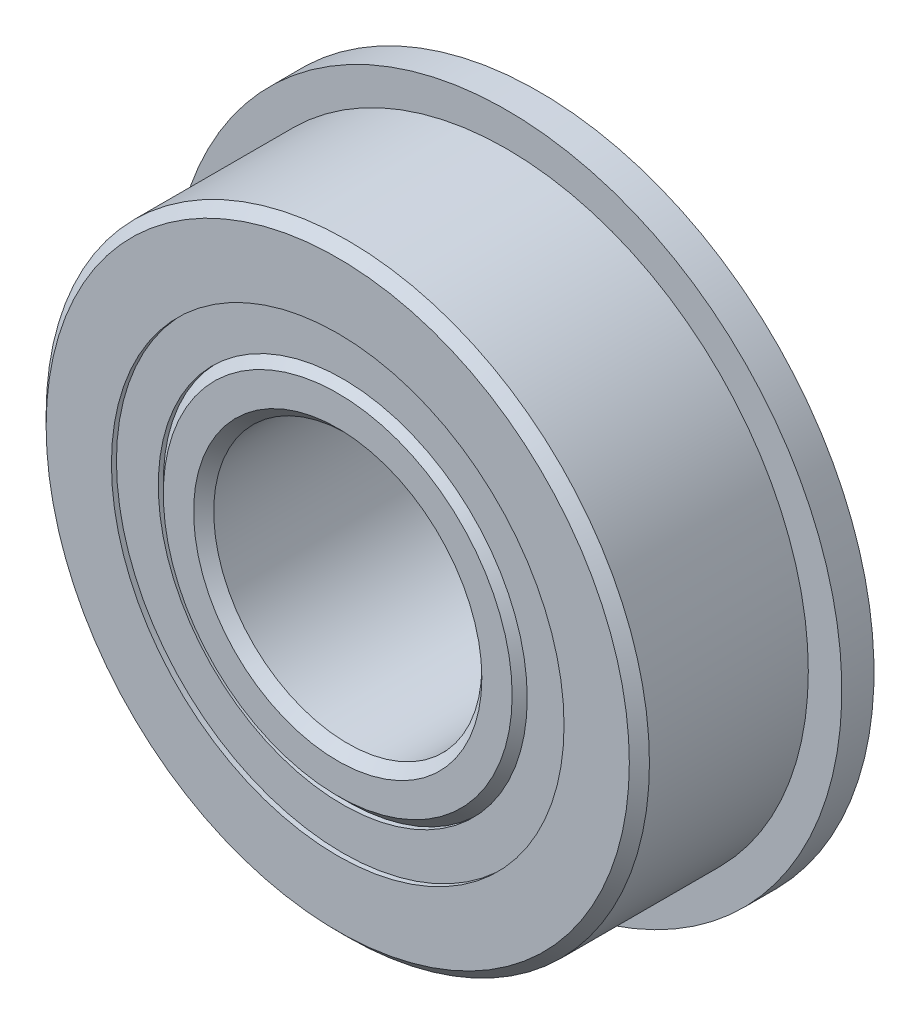
ISO-10303-21;
HEADER;
FILE_DESCRIPTION(('STEP AP214'),'2;1');
FILE_NAME('part.step','',(''),(''),'','','');
FILE_SCHEMA(('AUTOMOTIVE_DESIGN { 1 0 10303 214 1 1 1 1 }'));
ENDSEC;
DATA;
#1=APPLICATION_CONTEXT('core data for automotive mechanical design processes');
#2=APPLICATION_PROTOCOL_DEFINITION('international standard','automotive_design',2000,#1);
#3=PRODUCT_CONTEXT('',#1,'mechanical');
#4=PRODUCT('Part','Part','',(#3));
#5=PRODUCT_RELATED_PRODUCT_CATEGORY('part','',(#4));
#6=PRODUCT_DEFINITION_FORMATION('','',#4);
#7=PRODUCT_DEFINITION_CONTEXT('part definition',#1,'design');
#8=PRODUCT_DEFINITION('design','',#6,#7);
#9=PRODUCT_DEFINITION_SHAPE('','',#8);
#10=(LENGTH_UNIT() NAMED_UNIT(*) SI_UNIT(.MILLI.,.METRE.));
#11=(NAMED_UNIT(*) PLANE_ANGLE_UNIT() SI_UNIT($,.RADIAN.));
#12=(NAMED_UNIT(*) SI_UNIT($,.STERADIAN.) SOLID_ANGLE_UNIT());
#13=UNCERTAINTY_MEASURE_WITH_UNIT(LENGTH_MEASURE(1.E-05),#10,'distance_accuracy_value','');
#14=(GEOMETRIC_REPRESENTATION_CONTEXT(3) GLOBAL_UNCERTAINTY_ASSIGNED_CONTEXT((#13)) GLOBAL_UNIT_ASSIGNED_CONTEXT((#10,
#11,#12)) REPRESENTATION_CONTEXT('',''));
#15=CARTESIAN_POINT('',(0.,0.,0.));
#16=DIRECTION('',(0.,0.,1.));
#17=DIRECTION('',(1.,0.,0.));
#18=AXIS2_PLACEMENT_3D('',#15,#16,#17);
#19=CARTESIAN_POINT('',(0.,10.7188,-4.524375));
#20=DIRECTION('',(0.,0.,1.));
#21=DIRECTION('',(1.,0.,0.));
#22=AXIS2_PLACEMENT_3D('',#19,#20,#21);
#23=PLANE('',#22);
#24=CARTESIAN_POINT('',(0.,0.,-4.524375));
#25=DIRECTION('',(0.,0.,1.));
#26=DIRECTION('',(1.,0.,0.));
#27=AXIS2_PLACEMENT_3D('',#24,#25,#26);
#28=CIRCLE('',#27,10.7188);
#29=CARTESIAN_POINT('',(10.7188,0.,-4.524375));
#30=VERTEX_POINT('',#29);
#31=EDGE_CURVE('E59',#30,#30,#28,.T.);
#32=ORIENTED_EDGE('',*,*,#31,.F.);
#33=EDGE_LOOP('',(#32));
#34=FACE_BOUND('',#33,.T.);
#35=CARTESIAN_POINT('',(0.,0.,-4.524375));
#36=DIRECTION('',(0.,0.,1.));
#37=DIRECTION('',(1.,0.,0.));
#38=AXIS2_PLACEMENT_3D('',#35,#36,#37);
#39=CIRCLE('',#38,8.7376);
#40=CARTESIAN_POINT('',(8.7376,0.,-4.524375));
#41=VERTEX_POINT('',#40);
#42=EDGE_CURVE('E11',#41,#41,#39,.T.);
#43=ORIENTED_EDGE('',*,*,#42,.T.);
#44=EDGE_LOOP('',(#43));
#45=FACE_BOUND('',#44,.T.);
#46=ADVANCED_FACE('F45',(#34,#45),#23,.F.);
#47=CARTESIAN_POINT('',(0.,0.,4.7625));
#48=DIRECTION('',(0.,0.,1.));
#49=DIRECTION('',(1.,0.,0.));
#50=AXIS2_PLACEMENT_3D('',#47,#48,#49);
#51=CYLINDRICAL_SURFACE('',#50,8.7376);
#52=ORIENTED_EDGE('',*,*,#42,.F.);
#53=EDGE_LOOP('',(#52));
#54=FACE_BOUND('',#53,.T.);
#55=CARTESIAN_POINT('',(0.,0.,-1.78053818830151));
#56=DIRECTION('',(0.,0.,1.));
#57=DIRECTION('',(1.,0.,0.));
#58=AXIS2_PLACEMENT_3D('',#55,#56,#57);
#59=CIRCLE('',#58,8.7376);
#60=CARTESIAN_POINT('',(8.7376,0.,-1.78053818830151));
#61=VERTEX_POINT('',#60);
#62=EDGE_CURVE('E51',#61,#61,#59,.T.);
#63=ORIENTED_EDGE('',*,*,#62,.T.);
#64=EDGE_LOOP('',(#63));
#65=FACE_BOUND('',#64,.T.);
#66=ADVANCED_FACE('F68',(#54,#65),#51,.F.);
#67=CARTESIAN_POINT('',(0.,10.7188,-1.78053818830151));
#68=DIRECTION('',(0.,0.,-1.));
#69=DIRECTION('',(-1.,0.,0.));
#70=AXIS2_PLACEMENT_3D('',#67,#68,#69);
#71=PLANE('',#70);
#72=ORIENTED_EDGE('',*,*,#62,.F.);
#73=EDGE_LOOP('',(#72));
#74=FACE_BOUND('',#73,.T.);
#75=CARTESIAN_POINT('',(0.,0.,-1.78053818830151));
#76=DIRECTION('',(0.,0.,1.));
#77=DIRECTION('',(1.,0.,0.));
#78=AXIS2_PLACEMENT_3D('',#75,#76,#77);
#79=CIRCLE('',#78,10.7188);
#80=CARTESIAN_POINT('',(10.7188,0.,-1.78053818830151));
#81=VERTEX_POINT('',#80);
#82=EDGE_CURVE('E55',#81,#81,#79,.T.);
#83=ORIENTED_EDGE('',*,*,#82,.T.);
#84=EDGE_LOOP('',(#83));
#85=FACE_BOUND('',#84,.T.);
#86=ADVANCED_FACE('F72',(#74,#85),#71,.F.);
#87=CARTESIAN_POINT('',(0.,0.,4.7625));
#88=DIRECTION('',(0.,0.,1.));
#89=DIRECTION('',(1.,0.,0.));
#90=AXIS2_PLACEMENT_3D('',#87,#88,#89);
#91=CYLINDRICAL_SURFACE('',#90,10.7188);
#92=ORIENTED_EDGE('',*,*,#82,.F.);
#93=EDGE_LOOP('',(#92));
#94=FACE_BOUND('',#93,.T.);
#95=ORIENTED_EDGE('',*,*,#31,.T.);
#96=EDGE_LOOP('',(#95));
#97=FACE_BOUND('',#96,.T.);
#98=ADVANCED_FACE('F65',(#94,#97),#91,.T.);
#99=CLOSED_SHELL('',(#46,#66,#86,#98));
#100=MANIFOLD_SOLID_BREP('B2',#99);
#101=CARTESIAN_POINT('',(0.,10.7188,4.524375));
#102=DIRECTION('',(0.,0.,-1.));
#103=DIRECTION('',(-1.,0.,0.));
#104=AXIS2_PLACEMENT_3D('',#101,#102,#103);
#105=PLANE('',#104);
#106=CARTESIAN_POINT('',(0.,0.,4.524375));
#107=DIRECTION('',(0.,0.,1.));
#108=DIRECTION('',(1.,0.,0.));
#109=AXIS2_PLACEMENT_3D('',#106,#107,#108);
#110=CIRCLE('',#109,8.7376);
#111=CARTESIAN_POINT('',(8.7376,0.,4.524375));
#112=VERTEX_POINT('',#111);
#113=EDGE_CURVE('E44',#112,#112,#110,.T.);
#114=ORIENTED_EDGE('',*,*,#113,.F.);
#115=EDGE_LOOP('',(#114));
#116=FACE_BOUND('',#115,.T.);
#117=CARTESIAN_POINT('',(0.,0.,4.524375));
#118=DIRECTION('',(0.,0.,1.));
#119=DIRECTION('',(1.,0.,0.));
#120=AXIS2_PLACEMENT_3D('',#117,#118,#119);
#121=CIRCLE('',#120,10.7188);
#122=CARTESIAN_POINT('',(10.7188,0.,4.524375));
#123=VERTEX_POINT('',#122);
#124=EDGE_CURVE('E142',#123,#123,#121,.T.);
#125=ORIENTED_EDGE('',*,*,#124,.T.);
#126=EDGE_LOOP('',(#125));
#127=FACE_BOUND('',#126,.T.);
#128=ADVANCED_FACE('F128',(#116,#127),#105,.F.);
#129=CARTESIAN_POINT('',(0.,0.,4.7625));
#130=DIRECTION('',(0.,0.,1.));
#131=DIRECTION('',(1.,0.,0.));
#132=AXIS2_PLACEMENT_3D('',#129,#130,#131);
#133=CYLINDRICAL_SURFACE('',#132,8.7376);
#134=CARTESIAN_POINT('',(0.,0.,1.7805381883015));
#135=DIRECTION('',(0.,0.,1.));
#136=DIRECTION('',(1.,0.,0.));
#137=AXIS2_PLACEMENT_3D('',#134,#135,#136);
#138=CIRCLE('',#137,8.7376);
#139=CARTESIAN_POINT('',(8.7376,0.,1.7805381883015));
#140=VERTEX_POINT('',#139);
#141=EDGE_CURVE('E134',#140,#140,#138,.T.);
#142=ORIENTED_EDGE('',*,*,#141,.F.);
#143=EDGE_LOOP('',(#142));
#144=FACE_BOUND('',#143,.T.);
#145=ORIENTED_EDGE('',*,*,#113,.T.);
#146=EDGE_LOOP('',(#145));
#147=FACE_BOUND('',#146,.T.);
#148=ADVANCED_FACE('F157',(#144,#147),#133,.F.);
#149=CARTESIAN_POINT('',(0.,10.7188,1.78053818830151));
#150=DIRECTION('',(0.,0.,1.));
#151=DIRECTION('',(1.,0.,0.));
#152=AXIS2_PLACEMENT_3D('',#149,#150,#151);
#153=PLANE('',#152);
#154=CARTESIAN_POINT('',(0.,0.,1.78053818830151));
#155=DIRECTION('',(0.,0.,1.));
#156=DIRECTION('',(1.,0.,0.));
#157=AXIS2_PLACEMENT_3D('',#154,#155,#156);
#158=CIRCLE('',#157,10.7188);
#159=CARTESIAN_POINT('',(10.7188,0.,1.78053818830151));
#160=VERTEX_POINT('',#159);
#161=EDGE_CURVE('E138',#160,#160,#158,.T.);
#162=ORIENTED_EDGE('',*,*,#161,.F.);
#163=EDGE_LOOP('',(#162));
#164=FACE_BOUND('',#163,.T.);
#165=ORIENTED_EDGE('',*,*,#141,.T.);
#166=EDGE_LOOP('',(#165));
#167=FACE_BOUND('',#166,.T.);
#168=ADVANCED_FACE('F152',(#164,#167),#153,.F.);
#169=CARTESIAN_POINT('',(0.,0.,4.7625));
#170=DIRECTION('',(0.,0.,1.));
#171=DIRECTION('',(1.,0.,0.));
#172=AXIS2_PLACEMENT_3D('',#169,#170,#171);
#173=CYLINDRICAL_SURFACE('',#172,10.7188);
#174=ORIENTED_EDGE('',*,*,#124,.F.);
#175=EDGE_LOOP('',(#174));
#176=FACE_BOUND('',#175,.T.);
#177=ORIENTED_EDGE('',*,*,#161,.T.);
#178=EDGE_LOOP('',(#177));
#179=FACE_BOUND('',#178,.T.);
#180=ADVANCED_FACE('F149',(#176,#179),#173,.T.);
#181=CLOSED_SHELL('',(#128,#148,#168,#180));
#182=MANIFOLD_SOLID_BREP('B6',#181);
#183=CARTESIAN_POINT('',(-5.15937499999988,8.93629963530074,0.));
#184=DIRECTION('',(0.,0.,1.));
#185=DIRECTION('',(-0.499999999999989,0.866025403784445,0.));
#186=AXIS2_PLACEMENT_3D('',#183,#184,#185);
#187=SPHERICAL_SURFACE('',#186,2.38125);
#188=CARTESIAN_POINT('',(-5.15937499999988,8.93629963530074,2.38125000000001));
#189=VERTEX_POINT('',#188);
#190=VERTEX_LOOP('',#189);
#191=FACE_BOUND('',#190,.T.);
#192=ADVANCED_FACE('F211',(#191),#187,.T.);
#193=CLOSED_SHELL('',(#192));
#194=MANIFOLD_SOLID_BREP('B39',#193);
#195=CARTESIAN_POINT('',(-8.93629963530061,5.1593750000001,0.));
#196=DIRECTION('',(0.,0.,1.));
#197=DIRECTION('',(-0.866025403784433,0.50000000000001,0.));
#198=AXIS2_PLACEMENT_3D('',#195,#196,#197);
#199=SPHERICAL_SURFACE('',#198,2.38125);
#200=CARTESIAN_POINT('',(-8.93629963530061,5.1593750000001,2.38125000000001));
#201=VERTEX_POINT('',#200);
#202=VERTEX_LOOP('',#201);
#203=FACE_BOUND('',#202,.T.);
#204=ADVANCED_FACE('F231',(#203),#199,.T.);
#205=CLOSED_SHELL('',(#204));
#206=MANIFOLD_SOLID_BREP('B124',#205);
#207=CARTESIAN_POINT('',(-10.31875,1.08083169195563E-13,0.));
#208=DIRECTION('',(0.,0.,1.));
#209=DIRECTION('',(-1.,0.,0.));
#210=AXIS2_PLACEMENT_3D('',#207,#208,#209);
#211=SPHERICAL_SURFACE('',#210,2.38125);
#212=CARTESIAN_POINT('',(-10.31875,1.08083169195563E-13,2.38125000000001));
#213=VERTEX_POINT('',#212);
#214=VERTEX_LOOP('',#213);
#215=FACE_BOUND('',#214,.T.);
#216=ADVANCED_FACE('F251',(#215),#211,.T.);
#217=CLOSED_SHELL('',(#216));
#218=MANIFOLD_SOLID_BREP('B207',#217);
#219=CARTESIAN_POINT('',(-8.93629963530072,-5.15937499999992,0.));
#220=DIRECTION('',(0.,0.,1.));
#221=DIRECTION('',(-0.866025403784443,-0.499999999999992,0.));
#222=AXIS2_PLACEMENT_3D('',#219,#220,#221);
#223=SPHERICAL_SURFACE('',#222,2.38125);
#224=CARTESIAN_POINT('',(-8.93629963530072,-5.15937499999992,2.38125000000001));
#225=VERTEX_POINT('',#224);
#226=VERTEX_LOOP('',#225);
#227=FACE_BOUND('',#226,.T.);
#228=ADVANCED_FACE('F271',(#227),#223,.T.);
#229=CLOSED_SHELL('',(#228));
#230=MANIFOLD_SOLID_BREP('B227',#229);
#231=CARTESIAN_POINT('',(-5.15937500000007,-8.93629963530063,0.));
#232=DIRECTION('',(0.,0.,1.));
#233=DIRECTION('',(-0.500000000000007,-0.866025403784435,0.));
#234=AXIS2_PLACEMENT_3D('',#231,#232,#233);
#235=SPHERICAL_SURFACE('',#234,2.38125);
#236=CARTESIAN_POINT('',(-5.15937500000007,-8.93629963530063,2.38125000000001));
#237=VERTEX_POINT('',#236);
#238=VERTEX_LOOP('',#237);
#239=FACE_BOUND('',#238,.T.);
#240=ADVANCED_FACE('F291',(#239),#235,.T.);
#241=CLOSED_SHELL('',(#240));
#242=MANIFOLD_SOLID_BREP('B247',#241);
#243=CARTESIAN_POINT('',(0.,-10.31875,0.));
#244=DIRECTION('',(0.,0.,1.));
#245=DIRECTION('',(0.,-1.,0.));
#246=AXIS2_PLACEMENT_3D('',#243,#244,#245);
#247=SPHERICAL_SURFACE('',#246,2.38125);
#248=CARTESIAN_POINT('',(0.,-10.31875,2.38125000000001));
#249=VERTEX_POINT('',#248);
#250=VERTEX_LOOP('',#249);
#251=FACE_BOUND('',#250,.T.);
#252=ADVANCED_FACE('F311',(#251),#247,.T.);
#253=CLOSED_SHELL('',(#252));
#254=MANIFOLD_SOLID_BREP('B267',#253);
#255=CARTESIAN_POINT('',(5.15937499999995,-8.9362996353007,0.));
#256=DIRECTION('',(0.,0.,1.));
#257=DIRECTION('',(0.499999999999995,-0.866025403784442,0.));
#258=AXIS2_PLACEMENT_3D('',#255,#256,#257);
#259=SPHERICAL_SURFACE('',#258,2.38125);
#260=CARTESIAN_POINT('',(5.15937499999995,-8.9362996353007,2.38125000000001));
#261=VERTEX_POINT('',#260);
#262=VERTEX_LOOP('',#261);
#263=FACE_BOUND('',#262,.T.);
#264=ADVANCED_FACE('F331',(#263),#259,.T.);
#265=CLOSED_SHELL('',(#264));
#266=MANIFOLD_SOLID_BREP('B287',#265);
#267=CARTESIAN_POINT('',(8.93629963530065,-5.15937500000004,0.));
#268=DIRECTION('',(0.,0.,1.));
#269=DIRECTION('',(0.866025403784436,-0.500000000000004,0.));
#270=AXIS2_PLACEMENT_3D('',#267,#268,#269);
#271=SPHERICAL_SURFACE('',#270,2.38125);
#272=CARTESIAN_POINT('',(8.93629963530065,-5.15937500000004,2.38125000000001));
#273=VERTEX_POINT('',#272);
#274=VERTEX_LOOP('',#273);
#275=FACE_BOUND('',#274,.T.);
#276=ADVANCED_FACE('F351',(#275),#271,.T.);
#277=CLOSED_SHELL('',(#276));
#278=MANIFOLD_SOLID_BREP('B307',#277);
#279=CARTESIAN_POINT('',(10.31875,0.,0.));
#280=DIRECTION('',(0.,0.,1.));
#281=DIRECTION('',(1.,0.,0.));
#282=AXIS2_PLACEMENT_3D('',#279,#280,#281);
#283=SPHERICAL_SURFACE('',#282,2.38125);
#284=CARTESIAN_POINT('',(10.31875,0.,2.38125000000001));
#285=VERTEX_POINT('',#284);
#286=VERTEX_LOOP('',#285);
#287=FACE_BOUND('',#286,.T.);
#288=ADVANCED_FACE('F371',(#287),#283,.T.);
#289=CLOSED_SHELL('',(#288));
#290=MANIFOLD_SOLID_BREP('B327',#289);
#291=CARTESIAN_POINT('',(8.93629963530069,5.15937499999998,0.));
#292=DIRECTION('',(0.,0.,1.));
#293=DIRECTION('',(0.86602540378444,0.499999999999998,0.));
#294=AXIS2_PLACEMENT_3D('',#291,#292,#293);
#295=SPHERICAL_SURFACE('',#294,2.38125);
#296=CARTESIAN_POINT('',(8.93629963530069,5.15937499999998,2.38125000000001));
#297=VERTEX_POINT('',#296);
#298=VERTEX_LOOP('',#297);
#299=FACE_BOUND('',#298,.T.);
#300=ADVANCED_FACE('F391',(#299),#295,.T.);
#301=CLOSED_SHELL('',(#300));
#302=MANIFOLD_SOLID_BREP('B347',#301);
#303=CARTESIAN_POINT('',(5.15937500000001,8.93629963530067,0.));
#304=DIRECTION('',(0.,0.,1.));
#305=DIRECTION('',(0.500000000000001,0.866025403784438,0.));
#306=AXIS2_PLACEMENT_3D('',#303,#304,#305);
#307=SPHERICAL_SURFACE('',#306,2.38125);
#308=CARTESIAN_POINT('',(5.15937500000001,8.93629963530067,2.38125000000001));
#309=VERTEX_POINT('',#308);
#310=VERTEX_LOOP('',#309);
#311=FACE_BOUND('',#310,.T.);
#312=ADVANCED_FACE('F411',(#311),#307,.T.);
#313=CLOSED_SHELL('',(#312));
#314=MANIFOLD_SOLID_BREP('B367',#313);
#315=CARTESIAN_POINT('',(0.,10.31875,0.));
#316=DIRECTION('',(0.,0.,1.));
#317=DIRECTION('',(0.,1.,0.));
#318=AXIS2_PLACEMENT_3D('',#315,#316,#317);
#319=SPHERICAL_SURFACE('',#318,2.38125);
#320=CARTESIAN_POINT('',(0.,10.31875,2.38125000000001));
#321=VERTEX_POINT('',#320);
#322=VERTEX_LOOP('',#321);
#323=FACE_BOUND('',#322,.T.);
#324=ADVANCED_FACE('F433',(#323),#319,.T.);
#325=CLOSED_SHELL('',(#324));
#326=MANIFOLD_SOLID_BREP('B387',#325);
#327=CARTESIAN_POINT('',(0.,0.,4.28625));
#328=DIRECTION('',(0.,0.,-1.));
#329=DIRECTION('',(-1.,0.,0.));
#330=AXIS2_PLACEMENT_3D('',#327,#328,#329);
#331=CONICAL_SURFACE('',#330,8.7376,0.785398163397447);
#332=CARTESIAN_POINT('',(0.,0.,4.7625));
#333=DIRECTION('',(0.,0.,1.));
#334=DIRECTION('',(1.,0.,0.));
#335=AXIS2_PLACEMENT_3D('',#332,#333,#334);
#336=CIRCLE('',#335,8.26135);
#337=CARTESIAN_POINT('',(8.26135,0.,4.7625));
#338=VERTEX_POINT('',#337);
#339=EDGE_CURVE('E432',#338,#338,#336,.T.);
#340=ORIENTED_EDGE('',*,*,#339,.F.);
#341=EDGE_LOOP('',(#340));
#342=FACE_BOUND('',#341,.T.);
#343=CARTESIAN_POINT('',(0.,0.,4.28625));
#344=DIRECTION('',(0.,0.,1.));
#345=DIRECTION('',(1.,0.,0.));
#346=AXIS2_PLACEMENT_3D('',#343,#344,#345);
#347=CIRCLE('',#346,8.7376);
#348=CARTESIAN_POINT('',(8.7376,0.,4.28625));
#349=VERTEX_POINT('',#348);
#350=EDGE_CURVE('E488',#349,#349,#347,.T.);
#351=ORIENTED_EDGE('',*,*,#350,.T.);
#352=EDGE_LOOP('',(#351));
#353=FACE_BOUND('',#352,.T.);
#354=ADVANCED_FACE('F454',(#342,#353),#331,.T.);
#355=CARTESIAN_POINT('',(0.,6.82625,4.7625));
#356=DIRECTION('',(0.,0.,-1.));
#357=DIRECTION('',(-1.,0.,0.));
#358=AXIS2_PLACEMENT_3D('',#355,#356,#357);
#359=PLANE('',#358);
#360=CARTESIAN_POINT('',(0.,0.,4.7625));
#361=DIRECTION('',(0.,0.,1.));
#362=DIRECTION('',(1.,0.,0.));
#363=AXIS2_PLACEMENT_3D('',#360,#361,#362);
#364=CIRCLE('',#363,6.82625);
#365=CARTESIAN_POINT('',(6.82625,0.,4.7625));
#366=VERTEX_POINT('',#365);
#367=EDGE_CURVE('E460',#366,#366,#364,.T.);
#368=ORIENTED_EDGE('',*,*,#367,.F.);
#369=EDGE_LOOP('',(#368));
#370=FACE_BOUND('',#369,.T.);
#371=ORIENTED_EDGE('',*,*,#339,.T.);
#372=EDGE_LOOP('',(#371));
#373=FACE_BOUND('',#372,.T.);
#374=ADVANCED_FACE('F537',(#370,#373),#359,.F.);
#375=CARTESIAN_POINT('',(0.,0.,4.7625));
#376=DIRECTION('',(0.,0.,1.));
#377=DIRECTION('',(1.,0.,0.));
#378=AXIS2_PLACEMENT_3D('',#375,#376,#377);
#379=CONICAL_SURFACE('',#378,6.82625,0.785398163397447);
#380=CARTESIAN_POINT('',(0.,0.,4.28625));
#381=DIRECTION('',(0.,0.,1.));
#382=DIRECTION('',(1.,0.,0.));
#383=AXIS2_PLACEMENT_3D('',#380,#381,#382);
#384=CIRCLE('',#383,6.35);
#385=CARTESIAN_POINT('',(6.35,0.,4.28625));
#386=VERTEX_POINT('',#385);
#387=EDGE_CURVE('E464',#386,#386,#384,.T.);
#388=ORIENTED_EDGE('',*,*,#387,.F.);
#389=EDGE_LOOP('',(#388));
#390=FACE_BOUND('',#389,.T.);
#391=ORIENTED_EDGE('',*,*,#367,.T.);
#392=EDGE_LOOP('',(#391));
#393=FACE_BOUND('',#392,.T.);
#394=ADVANCED_FACE('F532',(#390,#393),#379,.F.);
#395=CARTESIAN_POINT('',(0.,0.,4.7625));
#396=DIRECTION('',(0.,0.,1.));
#397=DIRECTION('',(1.,0.,0.));
#398=AXIS2_PLACEMENT_3D('',#395,#396,#397);
#399=CYLINDRICAL_SURFACE('',#398,6.35);
#400=CARTESIAN_POINT('',(0.,0.,-5.88645));
#401=DIRECTION('',(0.,0.,1.));
#402=DIRECTION('',(1.,0.,0.));
#403=AXIS2_PLACEMENT_3D('',#400,#401,#402);
#404=CIRCLE('',#403,6.35);
#405=CARTESIAN_POINT('',(6.35,0.,-5.88645));
#406=VERTEX_POINT('',#405);
#407=EDGE_CURVE('E468',#406,#406,#404,.T.);
#408=ORIENTED_EDGE('',*,*,#407,.F.);
#409=EDGE_LOOP('',(#408));
#410=FACE_BOUND('',#409,.T.);
#411=ORIENTED_EDGE('',*,*,#387,.T.);
#412=EDGE_LOOP('',(#411));
#413=FACE_BOUND('',#412,.T.);
#414=ADVANCED_FACE('F526',(#410,#413),#399,.F.);
#415=CARTESIAN_POINT('',(0.,0.,-5.88645));
#416=DIRECTION('',(0.,0.,-1.));
#417=DIRECTION('',(-1.,0.,0.));
#418=AXIS2_PLACEMENT_3D('',#415,#416,#417);
#419=CONICAL_SURFACE('',#418,6.35,0.785398163397448);
#420=CARTESIAN_POINT('',(0.,0.,-6.3627));
#421=DIRECTION('',(0.,0.,1.));
#422=DIRECTION('',(1.,0.,0.));
#423=AXIS2_PLACEMENT_3D('',#420,#421,#422);
#424=CIRCLE('',#423,6.82625);
#425=CARTESIAN_POINT('',(6.82625,0.,-6.3627));
#426=VERTEX_POINT('',#425);
#427=EDGE_CURVE('E473',#426,#426,#424,.T.);
#428=ORIENTED_EDGE('',*,*,#427,.F.);
#429=EDGE_LOOP('',(#428));
#430=FACE_BOUND('',#429,.T.);
#431=ORIENTED_EDGE('',*,*,#407,.T.);
#432=EDGE_LOOP('',(#431));
#433=FACE_BOUND('',#432,.T.);
#434=ADVANCED_FACE('F520',(#430,#433),#419,.F.);
#435=CARTESIAN_POINT('',(0.,8.26135,-6.3627));
#436=DIRECTION('',(0.,0.,1.));
#437=DIRECTION('',(1.,0.,0.));
#438=AXIS2_PLACEMENT_3D('',#435,#436,#437);
#439=PLANE('',#438);
#440=CARTESIAN_POINT('',(0.,0.,-6.3627));
#441=DIRECTION('',(0.,0.,1.));
#442=DIRECTION('',(1.,0.,0.));
#443=AXIS2_PLACEMENT_3D('',#440,#441,#442);
#444=CIRCLE('',#443,8.26135);
#445=CARTESIAN_POINT('',(8.26135,0.,-6.3627));
#446=VERTEX_POINT('',#445);
#447=EDGE_CURVE('E476',#446,#446,#444,.T.);
#448=ORIENTED_EDGE('',*,*,#447,.F.);
#449=EDGE_LOOP('',(#448));
#450=FACE_BOUND('',#449,.T.);
#451=ORIENTED_EDGE('',*,*,#427,.T.);
#452=EDGE_LOOP('',(#451));
#453=FACE_BOUND('',#452,.T.);
#454=ADVANCED_FACE('F514',(#450,#453),#439,.F.);
#455=CARTESIAN_POINT('',(0.,0.,-6.3627));
#456=DIRECTION('',(0.,0.,1.));
#457=DIRECTION('',(1.,0.,0.));
#458=AXIS2_PLACEMENT_3D('',#455,#456,#457);
#459=CONICAL_SURFACE('',#458,8.26135,0.785398163397448);
#460=CARTESIAN_POINT('',(0.,0.,-5.88645));
#461=DIRECTION('',(0.,0.,1.));
#462=DIRECTION('',(1.,0.,0.));
#463=AXIS2_PLACEMENT_3D('',#460,#461,#462);
#464=CIRCLE('',#463,8.7376);
#465=CARTESIAN_POINT('',(8.7376,0.,-5.88645));
#466=VERTEX_POINT('',#465);
#467=EDGE_CURVE('E479',#466,#466,#464,.T.);
#468=ORIENTED_EDGE('',*,*,#467,.F.);
#469=EDGE_LOOP('',(#468));
#470=FACE_BOUND('',#469,.T.);
#471=ORIENTED_EDGE('',*,*,#447,.T.);
#472=EDGE_LOOP('',(#471));
#473=FACE_BOUND('',#472,.T.);
#474=ADVANCED_FACE('F508',(#470,#473),#459,.T.);
#475=CARTESIAN_POINT('',(0.,0.,4.7625));
#476=DIRECTION('',(0.,0.,1.));
#477=DIRECTION('',(1.,0.,0.));
#478=AXIS2_PLACEMENT_3D('',#475,#476,#477);
#479=CYLINDRICAL_SURFACE('',#478,8.7376);
#480=CARTESIAN_POINT('',(0.,0.,-1.78053818830151));
#481=DIRECTION('',(0.,0.,1.));
#482=DIRECTION('',(1.,0.,0.));
#483=AXIS2_PLACEMENT_3D('',#480,#481,#482);
#484=CIRCLE('',#483,8.7376);
#485=CARTESIAN_POINT('',(8.7376,0.,-1.78053818830151));
#486=VERTEX_POINT('',#485);
#487=EDGE_CURVE('E482',#486,#486,#484,.T.);
#488=ORIENTED_EDGE('',*,*,#487,.F.);
#489=EDGE_LOOP('',(#488));
#490=FACE_BOUND('',#489,.T.);
#491=ORIENTED_EDGE('',*,*,#467,.T.);
#492=EDGE_LOOP('',(#491));
#493=FACE_BOUND('',#492,.T.);
#494=ADVANCED_FACE('F502',(#490,#493),#479,.T.);
#495=CARTESIAN_POINT('',(0.,0.,0.));
#496=DIRECTION('',(0.,0.,1.));
#497=DIRECTION('',(1.,0.,0.));
#498=AXIS2_PLACEMENT_3D('',#495,#496,#497);
#499=TOROIDAL_SURFACE('',#498,10.31875,2.38125);
#500=CARTESIAN_POINT('',(0.,0.,1.78053818830151));
#501=DIRECTION('',(0.,0.,1.));
#502=DIRECTION('',(1.,0.,0.));
#503=AXIS2_PLACEMENT_3D('',#500,#501,#502);
#504=CIRCLE('',#503,8.7376);
#505=CARTESIAN_POINT('',(8.7376,0.,1.78053818830151));
#506=VERTEX_POINT('',#505);
#507=EDGE_CURVE('E485',#506,#506,#504,.T.);
#508=ORIENTED_EDGE('',*,*,#507,.F.);
#509=EDGE_LOOP('',(#508));
#510=FACE_BOUND('',#509,.T.);
#511=ORIENTED_EDGE('',*,*,#487,.T.);
#512=EDGE_LOOP('',(#511));
#513=FACE_BOUND('',#512,.T.);
#514=ADVANCED_FACE('F496',(#510,#513),#499,.F.);
#515=CARTESIAN_POINT('',(0.,0.,4.7625));
#516=DIRECTION('',(0.,0.,1.));
#517=DIRECTION('',(1.,0.,0.));
#518=AXIS2_PLACEMENT_3D('',#515,#516,#517);
#519=CYLINDRICAL_SURFACE('',#518,8.7376);
#520=ORIENTED_EDGE('',*,*,#350,.F.);
#521=EDGE_LOOP('',(#520));
#522=FACE_BOUND('',#521,.T.);
#523=ORIENTED_EDGE('',*,*,#507,.T.);
#524=EDGE_LOOP('',(#523));
#525=FACE_BOUND('',#524,.T.);
#526=ADVANCED_FACE('F493',(#522,#525),#519,.T.);
#527=CLOSED_SHELL('',(#354,#374,#394,#414,#434,#454,#474,#494,#514,#526));
#528=MANIFOLD_SOLID_BREP('B407',#527);
#529=CARTESIAN_POINT('',(0.,0.,4.28625));
#530=DIRECTION('',(0.,0.,-1.));
#531=DIRECTION('',(-1.,0.,0.));
#532=AXIS2_PLACEMENT_3D('',#529,#530,#531);
#533=CONICAL_SURFACE('',#532,14.2875,0.785398163397442);
#534=CARTESIAN_POINT('',(0.,0.,4.7625));
#535=DIRECTION('',(0.,0.,1.));
#536=DIRECTION('',(1.,0.,0.));
#537=AXIS2_PLACEMENT_3D('',#534,#535,#536);
#538=CIRCLE('',#537,13.81125);
#539=CARTESIAN_POINT('',(13.81125,0.,4.7625));
#540=VERTEX_POINT('',#539);
#541=EDGE_CURVE('E707',#540,#540,#538,.T.);
#542=ORIENTED_EDGE('',*,*,#541,.F.);
#543=EDGE_LOOP('',(#542));
#544=FACE_BOUND('',#543,.T.);
#545=CARTESIAN_POINT('',(0.,0.,4.28625));
#546=DIRECTION('',(0.,0.,1.));
#547=DIRECTION('',(1.,0.,0.));
#548=AXIS2_PLACEMENT_3D('',#545,#546,#547);
#549=CIRCLE('',#548,14.2875);
#550=CARTESIAN_POINT('',(14.2875,0.,4.28625));
#551=VERTEX_POINT('',#550);
#552=EDGE_CURVE('E452',#551,#551,#549,.T.);
#553=ORIENTED_EDGE('',*,*,#552,.T.);
#554=EDGE_LOOP('',(#553));
#555=FACE_BOUND('',#554,.T.);
#556=ADVANCED_FACE('F633',(#544,#555),#533,.T.);
#557=CARTESIAN_POINT('',(0.,0.,4.7625));
#558=DIRECTION('',(0.,0.,1.));
#559=DIRECTION('',(1.,0.,0.));
#560=AXIS2_PLACEMENT_3D('',#557,#558,#559);
#561=CYLINDRICAL_SURFACE('',#560,14.2875);
#562=CARTESIAN_POINT('',(0.,0.,-3.2385));
#563=DIRECTION('',(0.,0.,1.));
#564=DIRECTION('',(1.,0.,0.));
#565=AXIS2_PLACEMENT_3D('',#562,#563,#564);
#566=CIRCLE('',#565,14.2875);
#567=CARTESIAN_POINT('',(14.2875,0.,-3.2385));
#568=VERTEX_POINT('',#567);
#569=EDGE_CURVE('E704',#568,#568,#566,.T.);
#570=ORIENTED_EDGE('',*,*,#569,.T.);
#571=EDGE_LOOP('',(#570));
#572=FACE_BOUND('',#571,.T.);
#573=ORIENTED_EDGE('',*,*,#552,.F.);
#574=EDGE_LOOP('',(#573));
#575=FACE_BOUND('',#574,.T.);
#576=ADVANCED_FACE('F742',(#572,#575),#561,.T.);
#577=CARTESIAN_POINT('',(0.,13.81125,-4.7625));
#578=DIRECTION('',(0.,0.,1.));
#579=DIRECTION('',(1.,0.,0.));
#580=AXIS2_PLACEMENT_3D('',#577,#578,#579);
#581=PLANE('',#580);
#582=CARTESIAN_POINT('',(0.,0.,-4.7625));
#583=DIRECTION('',(0.,0.,1.));
#584=DIRECTION('',(1.,0.,0.));
#585=AXIS2_PLACEMENT_3D('',#582,#583,#584);
#586=CIRCLE('',#585,10.7188);
#587=CARTESIAN_POINT('',(6.31125591113893,8.663759130084,-4.7625));
#588=VERTEX_POINT('',#587);
#589=CARTESIAN_POINT('',(6.61212513102915,8.43637805528017,-4.7625));
#590=VERTEX_POINT('',#589);
#591=EDGE_CURVE('E640',#588,#590,#586,.T.);
#592=ORIENTED_EDGE('',*,*,#591,.T.);
#593=DIRECTION('',(-0.616871770256852,-0.787063669000277,0.));
#594=VECTOR('',#593,1.);
#595=CARTESIAN_POINT('',(0.,0.,-4.7625));
#596=LINE('',#595,#594);
#597=CARTESIAN_POINT('',(9.79283935282753,12.4946357453794,-4.7625));
#598=VERTEX_POINT('',#597);
#599=EDGE_CURVE('E672',#598,#590,#596,.T.);
#600=ORIENTED_EDGE('',*,*,#599,.F.);
#601=CARTESIAN_POINT('',(0.,0.,-4.7625));
#602=DIRECTION('',(0.,0.,-1.));
#603=DIRECTION('',(-1.,0.,0.));
#604=AXIS2_PLACEMENT_3D('',#601,#602,#603);
#605=CIRCLE('',#604,15.875);
#606=CARTESIAN_POINT('',(9.49329985546307,12.7237134066382,-4.7625));
#607=VERTEX_POINT('',#606);
#608=EDGE_CURVE('E701',#598,#607,#605,.T.);
#609=ORIENTED_EDGE('',*,*,#608,.T.);
#610=DIRECTION('',(0.616871770256852,0.787063669000277,0.));
#611=VECTOR('',#610,1.);
#612=CARTESIAN_POINT('',(-0.296776679564741,0.232602726951672,-4.7625));
#613=LINE('',#612,#611);
#614=EDGE_CURVE('E721',#588,#607,#613,.T.);
#615=ORIENTED_EDGE('',*,*,#614,.F.);
#616=EDGE_LOOP('',(#592,#600,#609,#615));
#617=FACE_BOUND('',#616,.T.);
#618=ADVANCED_FACE('F719',(#617),#581,.F.);
#619=CARTESIAN_POINT('',(0.,0.,4.7625));
#620=DIRECTION('',(0.,0.,1.));
#621=DIRECTION('',(1.,0.,0.));
#622=AXIS2_PLACEMENT_3D('',#619,#620,#621);
#623=CYLINDRICAL_SURFACE('',#622,10.7188);
#624=CARTESIAN_POINT('',(0.,0.,-2.34740528243421));
#625=DIRECTION('',(0.,0.,1.));
#626=DIRECTION('',(1.,0.,0.));
#627=AXIS2_PLACEMENT_3D('',#624,#625,#626);
#628=CIRCLE('',#627,10.7188);
#629=CARTESIAN_POINT('',(10.7188,0.,-2.34740528243421));
#630=VERTEX_POINT('',#629);
#631=EDGE_CURVE('E716',#630,#630,#628,.T.);
#632=ORIENTED_EDGE('',*,*,#631,.T.);
#633=EDGE_LOOP('',(#632));
#634=FACE_BOUND('',#633,.T.);
#635=CARTESIAN_POINT('',(0.,0.,-4.75996));
#636=DIRECTION('',(0.,0.,-1.));
#637=DIRECTION('',(-1.,0.,0.));
#638=AXIS2_PLACEMENT_3D('',#635,#636,#637);
#639=CIRCLE('',#638,10.7188);
#640=CARTESIAN_POINT('',(6.61212513102915,8.43637805528017,-4.75996));
#641=VERTEX_POINT('',#640);
#642=CARTESIAN_POINT('',(6.31125591113893,8.663759130084,-4.75996));
#643=VERTEX_POINT('',#642);
#644=EDGE_CURVE('E682',#641,#643,#639,.F.);
#645=ORIENTED_EDGE('',*,*,#644,.F.);
#646=DIRECTION('',(0.,0.,-1.));
#647=VECTOR('',#646,1.);
#648=CARTESIAN_POINT('',(6.61212513102915,8.43637805528017,-4.75996));
#649=LINE('',#648,#647);
#650=EDGE_CURVE('E656',#641,#590,#649,.T.);
#651=ORIENTED_EDGE('',*,*,#650,.T.);
#652=ORIENTED_EDGE('',*,*,#591,.F.);
#653=DIRECTION('',(0.,0.,-1.));
#654=VECTOR('',#653,1.);
#655=CARTESIAN_POINT('',(6.31125591113893,8.663759130084,-4.75996));
#656=LINE('',#655,#654);
#657=EDGE_CURVE('E676',#643,#588,#656,.T.);
#658=ORIENTED_EDGE('',*,*,#657,.F.);
#659=EDGE_LOOP('',(#645,#651,#652,#658));
#660=FACE_BOUND('',#659,.T.);
#661=ADVANCED_FACE('F690',(#634,#660),#623,.F.);
#662=CARTESIAN_POINT('',(0.,0.,0.));
#663=DIRECTION('',(0.,0.,1.));
#664=DIRECTION('',(1.,0.,0.));
#665=AXIS2_PLACEMENT_3D('',#662,#663,#664);
#666=TOROIDAL_SURFACE('',#665,10.31875,2.38125);
#667=ORIENTED_EDGE('',*,*,#631,.F.);
#668=EDGE_LOOP('',(#667));
#669=FACE_BOUND('',#668,.T.);
#670=CARTESIAN_POINT('',(0.,0.,2.34740528243421));
#671=DIRECTION('',(0.,0.,1.));
#672=DIRECTION('',(1.,0.,0.));
#673=AXIS2_PLACEMENT_3D('',#670,#671,#672);
#674=CIRCLE('',#673,10.7188);
#675=CARTESIAN_POINT('',(10.7188,0.,2.34740528243421));
#676=VERTEX_POINT('',#675);
#677=EDGE_CURVE('E713',#676,#676,#674,.T.);
#678=ORIENTED_EDGE('',*,*,#677,.T.);
#679=EDGE_LOOP('',(#678));
#680=FACE_BOUND('',#679,.T.);
#681=ADVANCED_FACE('F760',(#669,#680),#666,.F.);
#682=CARTESIAN_POINT('',(0.,0.,4.7625));
#683=DIRECTION('',(0.,0.,1.));
#684=DIRECTION('',(1.,0.,0.));
#685=AXIS2_PLACEMENT_3D('',#682,#683,#684);
#686=CYLINDRICAL_SURFACE('',#685,10.7188);
#687=ORIENTED_EDGE('',*,*,#677,.F.);
#688=EDGE_LOOP('',(#687));
#689=FACE_BOUND('',#688,.T.);
#690=CARTESIAN_POINT('',(0.,0.,4.7625));
#691=DIRECTION('',(0.,0.,1.));
#692=DIRECTION('',(1.,0.,0.));
#693=AXIS2_PLACEMENT_3D('',#690,#691,#692);
#694=CIRCLE('',#693,10.7188);
#695=CARTESIAN_POINT('',(10.7188,0.,4.7625));
#696=VERTEX_POINT('',#695);
#697=EDGE_CURVE('E710',#696,#696,#694,.T.);
#698=ORIENTED_EDGE('',*,*,#697,.T.);
#699=EDGE_LOOP('',(#698));
#700=FACE_BOUND('',#699,.T.);
#701=ADVANCED_FACE('F754',(#689,#700),#686,.F.);
#702=CARTESIAN_POINT('',(0.,13.81125,4.7625));
#703=DIRECTION('',(0.,0.,-1.));
#704=DIRECTION('',(-1.,0.,0.));
#705=AXIS2_PLACEMENT_3D('',#702,#703,#704);
#706=PLANE('',#705);
#707=ORIENTED_EDGE('',*,*,#697,.F.);
#708=EDGE_LOOP('',(#707));
#709=FACE_BOUND('',#708,.T.);
#710=ORIENTED_EDGE('',*,*,#541,.T.);
#711=EDGE_LOOP('',(#710));
#712=FACE_BOUND('',#711,.T.);
#713=ADVANCED_FACE('F738',(#709,#712),#706,.F.);
#714=CARTESIAN_POINT('',(0.,10.7188,-3.2385));
#715=DIRECTION('',(0.,0.,1.));
#716=DIRECTION('',(1.,0.,0.));
#717=AXIS2_PLACEMENT_3D('',#714,#715,#716);
#718=PLANE('',#717);
#719=CARTESIAN_POINT('',(0.,0.,-3.2385));
#720=DIRECTION('',(0.,0.,-1.));
#721=DIRECTION('',(-1.,0.,0.));
#722=AXIS2_PLACEMENT_3D('',#719,#720,#721);
#723=CIRCLE('',#722,15.875);
#724=CARTESIAN_POINT('',(-15.875,0.,-3.2385));
#725=VERTEX_POINT('',#724);
#726=EDGE_CURVE('E698',#725,#725,#723,.T.);
#727=ORIENTED_EDGE('',*,*,#726,.F.);
#728=EDGE_LOOP('',(#727));
#729=FACE_BOUND('',#728,.T.);
#730=ORIENTED_EDGE('',*,*,#569,.F.);
#731=EDGE_LOOP('',(#730));
#732=FACE_BOUND('',#731,.T.);
#733=ADVANCED_FACE('F732',(#729,#732),#718,.T.);
#734=CARTESIAN_POINT('',(0.,0.,-4.7625));
#735=DIRECTION('',(0.,0.,-1.));
#736=DIRECTION('',(-1.,0.,0.));
#737=AXIS2_PLACEMENT_3D('',#734,#735,#736);
#738=CYLINDRICAL_SURFACE('',#737,15.875);
#739=DIRECTION('',(0.,0.,-1.));
#740=VECTOR('',#739,1.);
#741=CARTESIAN_POINT('',(9.79283935282753,12.4946357453794,-4.75996));
#742=LINE('',#741,#740);
#743=CARTESIAN_POINT('',(9.79283935282753,12.4946357453794,-4.75996));
#744=VERTEX_POINT('',#743);
#745=EDGE_CURVE('E693',#744,#598,#742,.T.);
#746=ORIENTED_EDGE('',*,*,#745,.F.);
#747=CARTESIAN_POINT('',(0.,0.,-4.75996));
#748=DIRECTION('',(0.,0.,-1.));
#749=DIRECTION('',(-1.,0.,0.));
#750=AXIS2_PLACEMENT_3D('',#747,#748,#749);
#751=CIRCLE('',#750,15.875);
#752=CARTESIAN_POINT('',(9.49329985546307,12.7237134066382,-4.75996));
#753=VERTEX_POINT('',#752);
#754=EDGE_CURVE('E681',#753,#744,#751,.T.);
#755=ORIENTED_EDGE('',*,*,#754,.F.);
#756=DIRECTION('',(0.,0.,-1.));
#757=VECTOR('',#756,1.);
#758=CARTESIAN_POINT('',(9.49329985546307,12.7237134066382,-4.75996));
#759=LINE('',#758,#757);
#760=EDGE_CURVE('E679',#753,#607,#759,.T.);
#761=ORIENTED_EDGE('',*,*,#760,.T.);
#762=ORIENTED_EDGE('',*,*,#608,.F.);
#763=EDGE_LOOP('',(#746,#755,#761,#762));
#764=FACE_BOUND('',#763,.T.);
#765=ORIENTED_EDGE('',*,*,#726,.T.);
#766=EDGE_LOOP('',(#765));
#767=FACE_BOUND('',#766,.T.);
#768=ADVANCED_FACE('F729',(#764,#767),#738,.T.);
#769=CARTESIAN_POINT('',(0.,0.,-4.75996));
#770=DIRECTION('',(0.787063669000277,-0.616871770256852,0.));
#771=DIRECTION('',(0.616871770256852,0.787063669000277,0.));
#772=AXIS2_PLACEMENT_3D('',#769,#770,#771);
#773=PLANE('',#772);
#774=ORIENTED_EDGE('',*,*,#599,.T.);
#775=ORIENTED_EDGE('',*,*,#650,.F.);
#776=DIRECTION('',(-0.616871770256852,-0.787063669000277,0.));
#777=VECTOR('',#776,1.);
#778=CARTESIAN_POINT('',(0.,0.,-4.75996));
#779=LINE('',#778,#777);
#780=EDGE_CURVE('E686',#744,#641,#779,.T.);
#781=ORIENTED_EDGE('',*,*,#780,.F.);
#782=ORIENTED_EDGE('',*,*,#745,.T.);
#783=EDGE_LOOP('',(#774,#775,#781,#782));
#784=FACE_BOUND('',#783,.T.);
#785=ADVANCED_FACE('F727',(#784),#773,.F.);
#786=CARTESIAN_POINT('',(-0.296776679564741,0.232602726951672,-4.75996));
#787=DIRECTION('',(-0.787063669000277,0.616871770256852,0.));
#788=DIRECTION('',(-0.616871770256852,-0.787063669000277,0.));
#789=AXIS2_PLACEMENT_3D('',#786,#787,#788);
#790=PLANE('',#789);
#791=ORIENTED_EDGE('',*,*,#614,.T.);
#792=ORIENTED_EDGE('',*,*,#760,.F.);
#793=DIRECTION('',(0.616871770256852,0.787063669000277,0.));
#794=VECTOR('',#793,1.);
#795=CARTESIAN_POINT('',(-0.296776679564741,0.232602726951672,-4.75996));
#796=LINE('',#795,#794);
#797=EDGE_CURVE('E647',#643,#753,#796,.T.);
#798=ORIENTED_EDGE('',*,*,#797,.F.);
#799=ORIENTED_EDGE('',*,*,#657,.T.);
#800=EDGE_LOOP('',(#791,#792,#798,#799));
#801=FACE_BOUND('',#800,.T.);
#802=ADVANCED_FACE('F674',(#801),#790,.F.);
#803=CARTESIAN_POINT('',(0.,0.,-4.75996));
#804=DIRECTION('',(0.,0.,-1.));
#805=DIRECTION('',(-1.,0.,0.));
#806=AXIS2_PLACEMENT_3D('',#803,#804,#805);
#807=PLANE('',#806);
#808=ORIENTED_EDGE('',*,*,#644,.T.);
#809=ORIENTED_EDGE('',*,*,#797,.T.);
#810=ORIENTED_EDGE('',*,*,#754,.T.);
#811=ORIENTED_EDGE('',*,*,#780,.T.);
#812=EDGE_LOOP('',(#808,#809,#810,#811));
#813=FACE_BOUND('',#812,.T.);
#814=ADVANCED_FACE('F685',(#813),#807,.T.);
#815=CLOSED_SHELL('',(#556,#576,#618,#661,#681,#701,#713,#733,#768,#785,#802,#814));
#816=MANIFOLD_SOLID_BREP('B427',#815);
#817=ADVANCED_BREP_SHAPE_REPRESENTATION('',(#18,#100,#182,#194,#206,#218,#230,#242,#254,#266,
#278,#290,#302,#314,#326,#528,#816),#14);
#818=SHAPE_DEFINITION_REPRESENTATION(#9,#817);
ENDSEC;
END-ISO-10303-21;
